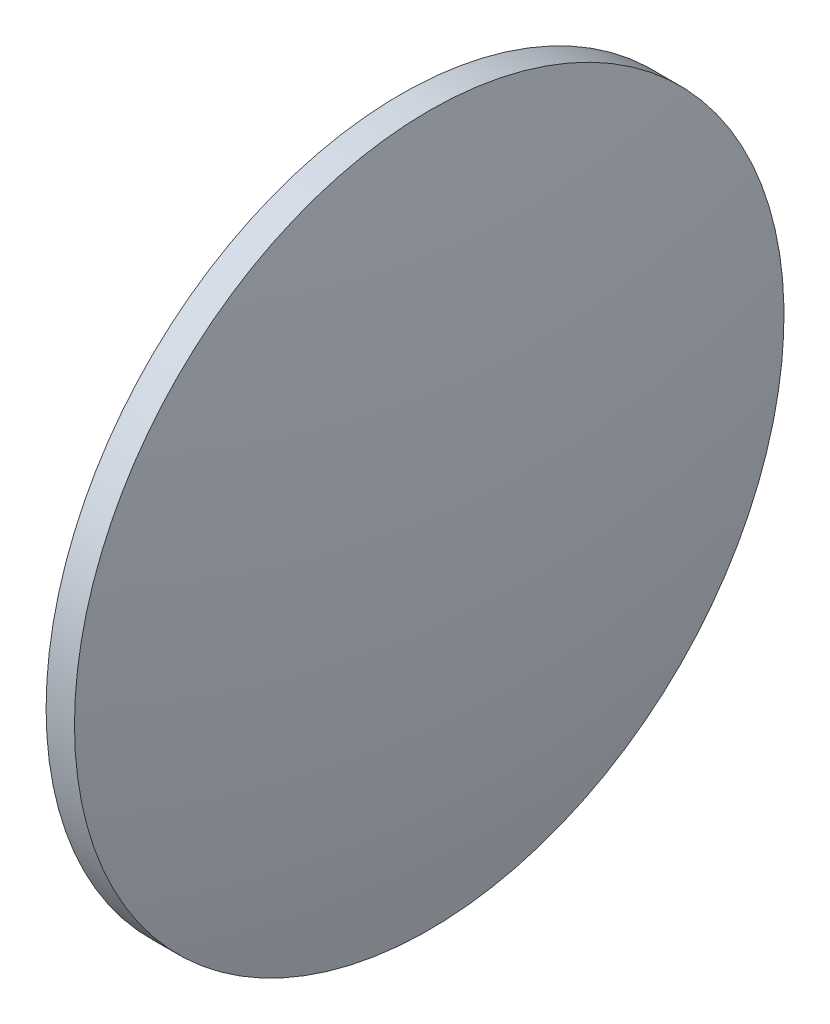
ISO-10303-21;
HEADER;
FILE_DESCRIPTION(('STEP AP214'),'2;1');
FILE_NAME('part.step','',(''),(''),'','','');
FILE_SCHEMA(('AUTOMOTIVE_DESIGN { 1 0 10303 214 1 1 1 1 }'));
ENDSEC;
DATA;
#1=APPLICATION_CONTEXT('core data for automotive mechanical design processes');
#2=APPLICATION_PROTOCOL_DEFINITION('international standard','automotive_design',2000,#1);
#3=PRODUCT_CONTEXT('',#1,'mechanical');
#4=PRODUCT('Part','Part','',(#3));
#5=PRODUCT_RELATED_PRODUCT_CATEGORY('part','',(#4));
#6=PRODUCT_DEFINITION_FORMATION('','',#4);
#7=PRODUCT_DEFINITION_CONTEXT('part definition',#1,'design');
#8=PRODUCT_DEFINITION('design','',#6,#7);
#9=PRODUCT_DEFINITION_SHAPE('','',#8);
#10=(LENGTH_UNIT() NAMED_UNIT(*) SI_UNIT(.MILLI.,.METRE.));
#11=(NAMED_UNIT(*) PLANE_ANGLE_UNIT() SI_UNIT($,.RADIAN.));
#12=(NAMED_UNIT(*) SI_UNIT($,.STERADIAN.) SOLID_ANGLE_UNIT());
#13=UNCERTAINTY_MEASURE_WITH_UNIT(LENGTH_MEASURE(1.E-05),#10,'distance_accuracy_value','');
#14=(GEOMETRIC_REPRESENTATION_CONTEXT(3) GLOBAL_UNCERTAINTY_ASSIGNED_CONTEXT((#13)) GLOBAL_UNIT_ASSIGNED_CONTEXT((#10,
#11,#12)) REPRESENTATION_CONTEXT('',''));
#15=CARTESIAN_POINT('',(0.,0.,0.));
#16=DIRECTION('',(0.,0.,1.));
#17=DIRECTION('',(1.,0.,0.));
#18=AXIS2_PLACEMENT_3D('',#15,#16,#17);
#19=CARTESIAN_POINT('',(-13.2398144521607,130.041890759925,0.));
#20=DIRECTION('',(-1.,0.,0.));
#21=DIRECTION('',(0.,1.,0.));
#22=AXIS2_PLACEMENT_3D('',#19,#20,#21);
#23=SPHERICAL_SURFACE('',#22,258.068721881392);
#24=CARTESIAN_POINT('',(239.938907429231,130.041890759925,0.));
#25=DIRECTION('',(-1.,0.,0.));
#26=DIRECTION('',(0.,0.,1.));
#27=AXIS2_PLACEMENT_3D('',#24,#25,#26);
#28=CIRCLE('',#27,50.);
#29=CARTESIAN_POINT('',(239.938907429231,130.041890759925,50.));
#30=VERTEX_POINT('',#29);
#31=EDGE_CURVE('E10',#30,#30,#28,.T.);
#32=ORIENTED_EDGE('',*,*,#31,.F.);
#33=EDGE_LOOP('',(#32));
#34=FACE_BOUND('',#33,.T.);
#35=ADVANCED_FACE('F33',(#34),#23,.T.);
#36=CARTESIAN_POINT('',(217.331148660887,130.041890759925,0.));
#37=DIRECTION('',(-1.,0.,0.));
#38=DIRECTION('',(0.,0.,1.));
#39=AXIS2_PLACEMENT_3D('',#36,#37,#38);
#40=CYLINDRICAL_SURFACE('',#39,50.);
#41=CARTESIAN_POINT('',(235.938907429231,130.041890759925,0.));
#42=DIRECTION('',(-1.,0.,0.));
#43=DIRECTION('',(0.,0.,1.));
#44=AXIS2_PLACEMENT_3D('',#41,#42,#43);
#45=CIRCLE('',#44,50.);
#46=CARTESIAN_POINT('',(235.938907429231,130.041890759925,50.));
#47=VERTEX_POINT('',#46);
#48=EDGE_CURVE('E39',#47,#47,#45,.T.);
#49=ORIENTED_EDGE('',*,*,#48,.F.);
#50=EDGE_LOOP('',(#49));
#51=FACE_BOUND('',#50,.T.);
#52=ORIENTED_EDGE('',*,*,#31,.T.);
#53=EDGE_LOOP('',(#52));
#54=FACE_BOUND('',#53,.T.);
#55=ADVANCED_FACE('F47',(#51,#54),#40,.T.);
#56=CARTESIAN_POINT('',(235.938907429231,130.041890759925,0.));
#57=DIRECTION('',(1.,0.,0.));
#58=DIRECTION('',(0.,0.,-1.));
#59=AXIS2_PLACEMENT_3D('',#56,#57,#58);
#60=PLANE('',#59);
#61=ORIENTED_EDGE('',*,*,#48,.T.);
#62=EDGE_LOOP('',(#61));
#63=FACE_BOUND('',#62,.T.);
#64=ADVANCED_FACE('F45',(#63),#60,.F.);
#65=CLOSED_SHELL('',(#35,#55,#64));
#66=MANIFOLD_SOLID_BREP('B2',#65);
#67=ADVANCED_BREP_SHAPE_REPRESENTATION('',(#18,#66),#14);
#68=SHAPE_DEFINITION_REPRESENTATION(#9,#67);
ENDSEC;
END-ISO-10303-21;
